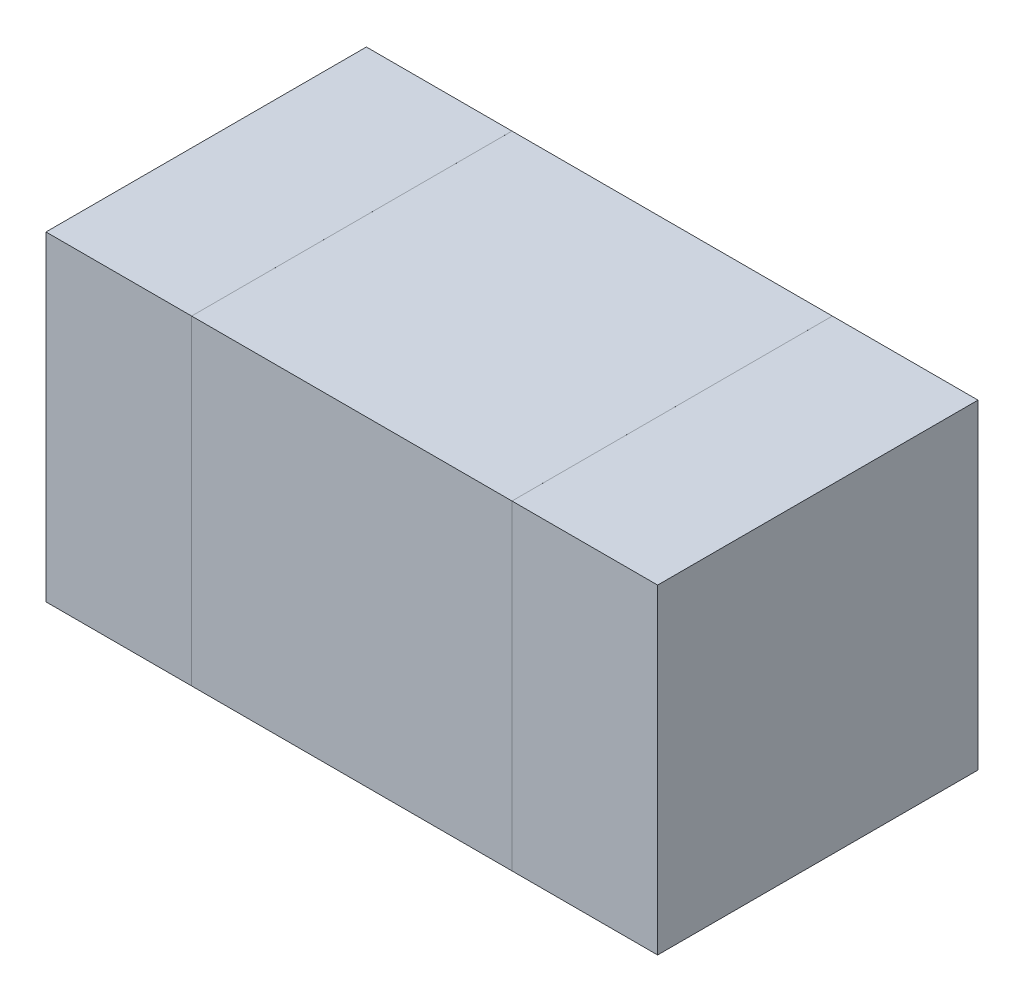
ISO-10303-21;
HEADER;
FILE_DESCRIPTION(('STEP AP214'),'2;1');
FILE_NAME('part.step','',(''),(''),'','','');
FILE_SCHEMA(('AUTOMOTIVE_DESIGN { 1 0 10303 214 1 1 1 1 }'));
ENDSEC;
DATA;
#1=APPLICATION_CONTEXT('core data for automotive mechanical design processes');
#2=APPLICATION_PROTOCOL_DEFINITION('international standard','automotive_design',2000,#1);
#3=PRODUCT_CONTEXT('',#1,'mechanical');
#4=PRODUCT('Part','Part','',(#3));
#5=PRODUCT_RELATED_PRODUCT_CATEGORY('part','',(#4));
#6=PRODUCT_DEFINITION_FORMATION('','',#4);
#7=PRODUCT_DEFINITION_CONTEXT('part definition',#1,'design');
#8=PRODUCT_DEFINITION('design','',#6,#7);
#9=PRODUCT_DEFINITION_SHAPE('','',#8);
#10=(LENGTH_UNIT() NAMED_UNIT(*) SI_UNIT(.MILLI.,.METRE.));
#11=(NAMED_UNIT(*) PLANE_ANGLE_UNIT() SI_UNIT($,.RADIAN.));
#12=(NAMED_UNIT(*) SI_UNIT($,.STERADIAN.) SOLID_ANGLE_UNIT());
#13=UNCERTAINTY_MEASURE_WITH_UNIT(LENGTH_MEASURE(1.E-05),#10,'distance_accuracy_value','');
#14=(GEOMETRIC_REPRESENTATION_CONTEXT(3) GLOBAL_UNCERTAINTY_ASSIGNED_CONTEXT((#13)) GLOBAL_UNIT_ASSIGNED_CONTEXT((#10,
#11,#12)) REPRESENTATION_CONTEXT('',''));
#15=CARTESIAN_POINT('',(0.,0.,0.));
#16=DIRECTION('',(0.,0.,1.));
#17=DIRECTION('',(1.,0.,0.));
#18=AXIS2_PLACEMENT_3D('',#15,#16,#17);
#19=CARTESIAN_POINT('',(3.460000129453,12.279998129141,0.32999934));
#20=DIRECTION('',(0.,0.,-1.));
#21=DIRECTION('',(0.,-1.,0.));
#22=AXIS2_PLACEMENT_3D('',#19,#20,#21);
#23=PLANE('',#22);
#24=DIRECTION('',(1.,0.,0.));
#25=VECTOR('',#24,1.);
#26=CARTESIAN_POINT('',(3.460000129453,12.279998129141,0.32999934));
#27=LINE('',#26,#25);
#28=CARTESIAN_POINT('',(3.460000129453,12.279998129141,0.32999934));
#29=VERTEX_POINT('',#28);
#30=CARTESIAN_POINT('',(3.790002009453,12.279998129141,0.32999934));
#31=VERTEX_POINT('',#30);
#32=EDGE_CURVE('P0_E78',#29,#31,#27,.T.);
#33=ORIENTED_EDGE('',*,*,#32,.T.);
#34=DIRECTION('',(0.,1.,0.));
#35=VECTOR('',#34,1.);
#36=CARTESIAN_POINT('',(3.790002009453,12.279998129141,0.32999934));
#37=LINE('',#36,#35);
#38=CARTESIAN_POINT('',(3.790002009453,12.609997469141,0.32999934));
#39=VERTEX_POINT('',#38);
#40=EDGE_CURVE('P0_E76',#31,#39,#37,.T.);
#41=ORIENTED_EDGE('',*,*,#40,.T.);
#42=DIRECTION('',(-1.,0.,0.));
#43=VECTOR('',#42,1.);
#44=CARTESIAN_POINT('',(3.790002009453,12.609997469141,0.32999934));
#45=LINE('',#44,#43);
#46=CARTESIAN_POINT('',(3.460000129453,12.609997469141,0.32999934));
#47=VERTEX_POINT('',#46);
#48=EDGE_CURVE('P0_E66',#39,#47,#45,.T.);
#49=ORIENTED_EDGE('',*,*,#48,.T.);
#50=DIRECTION('',(0.,-1.,0.));
#51=VECTOR('',#50,1.);
#52=CARTESIAN_POINT('',(3.460000129453,12.609997469141,0.32999934));
#53=LINE('',#52,#51);
#54=EDGE_CURVE('P0_E11',#47,#29,#53,.T.);
#55=ORIENTED_EDGE('',*,*,#54,.T.);
#56=EDGE_LOOP('',(#33,#41,#49,#55));
#57=FACE_BOUND('',#56,.T.);
#58=ADVANCED_FACE('P0_F17',(#57),#23,.F.);
#59=CARTESIAN_POINT('',(3.460000129453,12.279998129141,0.));
#60=DIRECTION('',(0.,0.,-1.));
#61=DIRECTION('',(0.,-1.,0.));
#62=AXIS2_PLACEMENT_3D('',#59,#60,#61);
#63=PLANE('',#62);
#64=DIRECTION('',(0.,-1.,0.));
#65=VECTOR('',#64,1.);
#66=CARTESIAN_POINT('',(3.460000129453,12.609997469141,0.));
#67=LINE('',#66,#65);
#68=CARTESIAN_POINT('',(3.460000129453,12.609997469141,0.));
#69=VERTEX_POINT('',#68);
#70=CARTESIAN_POINT('',(3.460000129453,12.279998129141,0.));
#71=VERTEX_POINT('',#70);
#72=EDGE_CURVE('P0_E20',#69,#71,#67,.T.);
#73=ORIENTED_EDGE('',*,*,#72,.F.);
#74=DIRECTION('',(-1.,0.,0.));
#75=VECTOR('',#74,1.);
#76=CARTESIAN_POINT('',(3.790002009453,12.609997469141,0.));
#77=LINE('',#76,#75);
#78=CARTESIAN_POINT('',(3.790002009453,12.609997469141,0.));
#79=VERTEX_POINT('',#78);
#80=EDGE_CURVE('P0_E59',#79,#69,#77,.T.);
#81=ORIENTED_EDGE('',*,*,#80,.F.);
#82=DIRECTION('',(0.,1.,0.));
#83=VECTOR('',#82,1.);
#84=CARTESIAN_POINT('',(3.790002009453,12.279998129141,0.));
#85=LINE('',#84,#83);
#86=CARTESIAN_POINT('',(3.790002009453,12.279998129141,0.));
#87=VERTEX_POINT('',#86);
#88=EDGE_CURVE('P0_E85',#87,#79,#85,.T.);
#89=ORIENTED_EDGE('',*,*,#88,.F.);
#90=DIRECTION('',(1.,0.,0.));
#91=VECTOR('',#90,1.);
#92=CARTESIAN_POINT('',(3.460000129453,12.279998129141,0.));
#93=LINE('',#92,#91);
#94=EDGE_CURVE('P0_E100',#71,#87,#93,.T.);
#95=ORIENTED_EDGE('',*,*,#94,.F.);
#96=EDGE_LOOP('',(#73,#81,#89,#95));
#97=FACE_BOUND('',#96,.T.);
#98=ADVANCED_FACE('P0_F122',(#97),#63,.T.);
#99=CARTESIAN_POINT('',(3.460000129453,12.609997469141,0.));
#100=DIRECTION('',(1.,0.,0.));
#101=DIRECTION('',(0.,1.,0.));
#102=AXIS2_PLACEMENT_3D('',#99,#100,#101);
#103=PLANE('',#102);
#104=ORIENTED_EDGE('',*,*,#72,.T.);
#105=DIRECTION('',(0.,0.,1.));
#106=VECTOR('',#105,1.);
#107=CARTESIAN_POINT('',(3.460000129453,12.279998129141,0.));
#108=LINE('',#107,#106);
#109=EDGE_CURVE('P0_E90',#71,#29,#108,.T.);
#110=ORIENTED_EDGE('',*,*,#109,.T.);
#111=ORIENTED_EDGE('',*,*,#54,.F.);
#112=DIRECTION('',(0.,0.,1.));
#113=VECTOR('',#112,1.);
#114=CARTESIAN_POINT('',(3.460000129453,12.609997469141,0.));
#115=LINE('',#114,#113);
#116=EDGE_CURVE('P0_E72',#69,#47,#115,.T.);
#117=ORIENTED_EDGE('',*,*,#116,.F.);
#118=EDGE_LOOP('',(#104,#110,#111,#117));
#119=FACE_BOUND('',#118,.T.);
#120=ADVANCED_FACE('P0_F128',(#119),#103,.F.);
#121=CARTESIAN_POINT('',(3.790002009453,12.609997469141,0.));
#122=DIRECTION('',(0.,-1.,0.));
#123=DIRECTION('',(0.,0.,-1.));
#124=AXIS2_PLACEMENT_3D('',#121,#122,#123);
#125=PLANE('',#124);
#126=ORIENTED_EDGE('',*,*,#80,.T.);
#127=ORIENTED_EDGE('',*,*,#116,.T.);
#128=ORIENTED_EDGE('',*,*,#48,.F.);
#129=DIRECTION('',(0.,0.,1.));
#130=VECTOR('',#129,1.);
#131=CARTESIAN_POINT('',(3.790002009453,12.609997469141,0.));
#132=LINE('',#131,#130);
#133=EDGE_CURVE('P0_E70',#79,#39,#132,.T.);
#134=ORIENTED_EDGE('',*,*,#133,.F.);
#135=EDGE_LOOP('',(#126,#127,#128,#134));
#136=FACE_BOUND('',#135,.T.);
#137=ADVANCED_FACE('P0_F68',(#136),#125,.F.);
#138=CARTESIAN_POINT('',(3.790002009453,12.279998129141,0.));
#139=DIRECTION('',(-1.,0.,0.));
#140=DIRECTION('',(0.,0.,1.));
#141=AXIS2_PLACEMENT_3D('',#138,#139,#140);
#142=PLANE('',#141);
#143=ORIENTED_EDGE('',*,*,#88,.T.);
#144=ORIENTED_EDGE('',*,*,#133,.T.);
#145=ORIENTED_EDGE('',*,*,#40,.F.);
#146=DIRECTION('',(0.,0.,1.));
#147=VECTOR('',#146,1.);
#148=CARTESIAN_POINT('',(3.790002009453,12.279998129141,0.));
#149=LINE('',#148,#147);
#150=EDGE_CURVE('P0_E97',#87,#31,#149,.T.);
#151=ORIENTED_EDGE('',*,*,#150,.F.);
#152=EDGE_LOOP('',(#143,#144,#145,#151));
#153=FACE_BOUND('',#152,.T.);
#154=ADVANCED_FACE('P0_F84',(#153),#142,.F.);
#155=CARTESIAN_POINT('',(3.460000129453,12.279998129141,0.));
#156=DIRECTION('',(0.,1.,0.));
#157=DIRECTION('',(1.,0.,0.));
#158=AXIS2_PLACEMENT_3D('',#155,#156,#157);
#159=PLANE('',#158);
#160=ORIENTED_EDGE('',*,*,#94,.T.);
#161=ORIENTED_EDGE('',*,*,#150,.T.);
#162=ORIENTED_EDGE('',*,*,#32,.F.);
#163=ORIENTED_EDGE('',*,*,#109,.F.);
#164=EDGE_LOOP('',(#160,#161,#162,#163));
#165=FACE_BOUND('',#164,.T.);
#166=ADVANCED_FACE('P0_F120',(#165),#159,.F.);
#167=CLOSED_SHELL('',(#58,#98,#120,#137,#154,#166));
#168=MANIFOLD_SOLID_BREP('P0_B1',#167);
#169=CARTESIAN_POINT('',(3.459996696289,12.279995589141,0.32999934));
#170=DIRECTION('',(0.,0.,-1.));
#171=DIRECTION('',(0.,-1.,0.));
#172=AXIS2_PLACEMENT_3D('',#169,#170,#171);
#173=PLANE('',#172);
#174=DIRECTION('',(0.,1.,0.));
#175=VECTOR('',#174,1.);
#176=CARTESIAN_POINT('',(3.459996696289,12.279995589141,0.32999934));
#177=LINE('',#176,#175);
#178=CARTESIAN_POINT('',(3.459996696289,12.279995589141,0.32999934));
#179=VERTEX_POINT('',#178);
#180=CARTESIAN_POINT('',(3.459996696289,12.609997469141,0.32999934));
#181=VERTEX_POINT('',#180);
#182=EDGE_CURVE('P1_E96',#179,#181,#177,.T.);
#183=ORIENTED_EDGE('',*,*,#182,.T.);
#184=DIRECTION('',(-1.,0.,0.));
#185=VECTOR('',#184,1.);
#186=CARTESIAN_POINT('',(3.459996696289,12.609997469141,0.32999934));
#187=LINE('',#186,#185);
#188=CARTESIAN_POINT('',(3.309994456289,12.609997469141,0.32999934));
#189=VERTEX_POINT('',#188);
#190=EDGE_CURVE('P1_E77',#181,#189,#187,.T.);
#191=ORIENTED_EDGE('',*,*,#190,.T.);
#192=DIRECTION('',(0.,-1.,0.));
#193=VECTOR('',#192,1.);
#194=CARTESIAN_POINT('',(3.309994456289,12.609997469141,0.32999934));
#195=LINE('',#194,#193);
#196=CARTESIAN_POINT('',(3.309994456289,12.279995589141,0.32999934));
#197=VERTEX_POINT('',#196);
#198=EDGE_CURVE('P1_E82',#189,#197,#195,.T.);
#199=ORIENTED_EDGE('',*,*,#198,.T.);
#200=DIRECTION('',(1.,0.,0.));
#201=VECTOR('',#200,1.);
#202=CARTESIAN_POINT('',(3.309994456289,12.279995589141,0.32999934));
#203=LINE('',#202,#201);
#204=EDGE_CURVE('P1_E11',#197,#179,#203,.T.);
#205=ORIENTED_EDGE('',*,*,#204,.T.);
#206=EDGE_LOOP('',(#183,#191,#199,#205));
#207=FACE_BOUND('',#206,.T.);
#208=ADVANCED_FACE('P1_F17',(#207),#173,.F.);
#209=CARTESIAN_POINT('',(3.459996696289,12.279995589141,0.));
#210=DIRECTION('',(0.,0.,-1.));
#211=DIRECTION('',(0.,-1.,0.));
#212=AXIS2_PLACEMENT_3D('',#209,#210,#211);
#213=PLANE('',#212);
#214=DIRECTION('',(1.,0.,0.));
#215=VECTOR('',#214,1.);
#216=CARTESIAN_POINT('',(3.309994456289,12.279995589141,0.));
#217=LINE('',#216,#215);
#218=CARTESIAN_POINT('',(3.309994456289,12.279995589141,0.));
#219=VERTEX_POINT('',#218);
#220=CARTESIAN_POINT('',(3.459996696289,12.279995589141,0.));
#221=VERTEX_POINT('',#220);
#222=EDGE_CURVE('P1_E26',#219,#221,#217,.T.);
#223=ORIENTED_EDGE('',*,*,#222,.F.);
#224=DIRECTION('',(0.,-1.,0.));
#225=VECTOR('',#224,1.);
#226=CARTESIAN_POINT('',(3.309994456289,12.609997469141,0.));
#227=LINE('',#226,#225);
#228=CARTESIAN_POINT('',(3.309994456289,12.609997469141,0.));
#229=VERTEX_POINT('',#228);
#230=EDGE_CURVE('P1_E68',#229,#219,#227,.T.);
#231=ORIENTED_EDGE('',*,*,#230,.F.);
#232=DIRECTION('',(-1.,0.,0.));
#233=VECTOR('',#232,1.);
#234=CARTESIAN_POINT('',(3.459996696289,12.609997469141,0.));
#235=LINE('',#234,#233);
#236=CARTESIAN_POINT('',(3.459996696289,12.609997469141,0.));
#237=VERTEX_POINT('',#236);
#238=EDGE_CURVE('P1_E72',#237,#229,#235,.T.);
#239=ORIENTED_EDGE('',*,*,#238,.F.);
#240=DIRECTION('',(0.,1.,0.));
#241=VECTOR('',#240,1.);
#242=CARTESIAN_POINT('',(3.459996696289,12.279995589141,0.));
#243=LINE('',#242,#241);
#244=EDGE_CURVE('P1_E111',#221,#237,#243,.T.);
#245=ORIENTED_EDGE('',*,*,#244,.F.);
#246=EDGE_LOOP('',(#223,#231,#239,#245));
#247=FACE_BOUND('',#246,.T.);
#248=ADVANCED_FACE('P1_F70',(#247),#213,.T.);
#249=CARTESIAN_POINT('',(3.309994456289,12.279995589141,0.));
#250=DIRECTION('',(0.,1.,0.));
#251=DIRECTION('',(1.,0.,0.));
#252=AXIS2_PLACEMENT_3D('',#249,#250,#251);
#253=PLANE('',#252);
#254=ORIENTED_EDGE('',*,*,#222,.T.);
#255=DIRECTION('',(0.,0.,1.));
#256=VECTOR('',#255,1.);
#257=CARTESIAN_POINT('',(3.459996696289,12.279995589141,0.));
#258=LINE('',#257,#256);
#259=EDGE_CURVE('P1_E92',#221,#179,#258,.T.);
#260=ORIENTED_EDGE('',*,*,#259,.T.);
#261=ORIENTED_EDGE('',*,*,#204,.F.);
#262=DIRECTION('',(0.,0.,1.));
#263=VECTOR('',#262,1.);
#264=CARTESIAN_POINT('',(3.309994456289,12.279995589141,0.));
#265=LINE('',#264,#263);
#266=EDGE_CURVE('P1_E20',#219,#197,#265,.T.);
#267=ORIENTED_EDGE('',*,*,#266,.F.);
#268=EDGE_LOOP('',(#254,#260,#261,#267));
#269=FACE_BOUND('',#268,.T.);
#270=ADVANCED_FACE('P1_F120',(#269),#253,.F.);
#271=CARTESIAN_POINT('',(3.309994456289,12.609997469141,0.));
#272=DIRECTION('',(1.,0.,0.));
#273=DIRECTION('',(0.,1.,0.));
#274=AXIS2_PLACEMENT_3D('',#271,#272,#273);
#275=PLANE('',#274);
#276=ORIENTED_EDGE('',*,*,#230,.T.);
#277=ORIENTED_EDGE('',*,*,#266,.T.);
#278=ORIENTED_EDGE('',*,*,#198,.F.);
#279=DIRECTION('',(0.,0.,1.));
#280=VECTOR('',#279,1.);
#281=CARTESIAN_POINT('',(3.309994456289,12.609997469141,0.));
#282=LINE('',#281,#280);
#283=EDGE_CURVE('P1_E80',#229,#189,#282,.T.);
#284=ORIENTED_EDGE('',*,*,#283,.F.);
#285=EDGE_LOOP('',(#276,#277,#278,#284));
#286=FACE_BOUND('',#285,.T.);
#287=ADVANCED_FACE('P1_F81',(#286),#275,.F.);
#288=CARTESIAN_POINT('',(3.459996696289,12.609997469141,0.));
#289=DIRECTION('',(0.,-1.,0.));
#290=DIRECTION('',(0.,0.,-1.));
#291=AXIS2_PLACEMENT_3D('',#288,#289,#290);
#292=PLANE('',#291);
#293=ORIENTED_EDGE('',*,*,#238,.T.);
#294=ORIENTED_EDGE('',*,*,#283,.T.);
#295=ORIENTED_EDGE('',*,*,#190,.F.);
#296=DIRECTION('',(0.,0.,1.));
#297=VECTOR('',#296,1.);
#298=CARTESIAN_POINT('',(3.459996696289,12.609997469141,0.));
#299=LINE('',#298,#297);
#300=EDGE_CURVE('P1_E89',#237,#181,#299,.T.);
#301=ORIENTED_EDGE('',*,*,#300,.F.);
#302=EDGE_LOOP('',(#293,#294,#295,#301));
#303=FACE_BOUND('',#302,.T.);
#304=ADVANCED_FACE('P1_F87',(#303),#292,.F.);
#305=CARTESIAN_POINT('',(3.459996696289,12.279995589141,0.));
#306=DIRECTION('',(-1.,0.,0.));
#307=DIRECTION('',(0.,0.,1.));
#308=AXIS2_PLACEMENT_3D('',#305,#306,#307);
#309=PLANE('',#308);
#310=ORIENTED_EDGE('',*,*,#244,.T.);
#311=ORIENTED_EDGE('',*,*,#300,.T.);
#312=ORIENTED_EDGE('',*,*,#182,.F.);
#313=ORIENTED_EDGE('',*,*,#259,.F.);
#314=EDGE_LOOP('',(#310,#311,#312,#313));
#315=FACE_BOUND('',#314,.T.);
#316=ADVANCED_FACE('P1_F110',(#315),#309,.F.);
#317=CLOSED_SHELL('',(#208,#248,#270,#287,#304,#316));
#318=MANIFOLD_SOLID_BREP('P1_B1',#317);
#319=CARTESIAN_POINT('',(3.940007682617,12.279995589141,0.32999934));
#320=DIRECTION('',(0.,0.,-1.));
#321=DIRECTION('',(0.,-1.,0.));
#322=AXIS2_PLACEMENT_3D('',#319,#320,#321);
#323=PLANE('',#322);
#324=DIRECTION('',(0.,1.,0.));
#325=VECTOR('',#324,1.);
#326=CARTESIAN_POINT('',(3.940007682617,12.279995589141,0.32999934));
#327=LINE('',#326,#325);
#328=CARTESIAN_POINT('',(3.940007682617,12.279995589141,0.32999934));
#329=VERTEX_POINT('',#328);
#330=CARTESIAN_POINT('',(3.940007682617,12.609997469141,0.32999934));
#331=VERTEX_POINT('',#330);
#332=EDGE_CURVE('P2_E93',#329,#331,#327,.T.);
#333=ORIENTED_EDGE('',*,*,#332,.T.);
#334=DIRECTION('',(-1.,0.,0.));
#335=VECTOR('',#334,1.);
#336=CARTESIAN_POINT('',(3.940007682617,12.609997469141,0.32999934));
#337=LINE('',#336,#335);
#338=CARTESIAN_POINT('',(3.790005442617,12.609997469141,0.32999934));
#339=VERTEX_POINT('',#338);
#340=EDGE_CURVE('P2_E72',#331,#339,#337,.T.);
#341=ORIENTED_EDGE('',*,*,#340,.T.);
#342=DIRECTION('',(0.,-1.,0.));
#343=VECTOR('',#342,1.);
#344=CARTESIAN_POINT('',(3.790005442617,12.609997469141,0.32999934));
#345=LINE('',#344,#343);
#346=CARTESIAN_POINT('',(3.790005442617,12.279995589141,0.32999934));
#347=VERTEX_POINT('',#346);
#348=EDGE_CURVE('P2_E76',#339,#347,#345,.T.);
#349=ORIENTED_EDGE('',*,*,#348,.T.);
#350=DIRECTION('',(1.,0.,0.));
#351=VECTOR('',#350,1.);
#352=CARTESIAN_POINT('',(3.790005442617,12.279995589141,0.32999934));
#353=LINE('',#352,#351);
#354=EDGE_CURVE('P2_E11',#347,#329,#353,.T.);
#355=ORIENTED_EDGE('',*,*,#354,.T.);
#356=EDGE_LOOP('',(#333,#341,#349,#355));
#357=FACE_BOUND('',#356,.T.);
#358=ADVANCED_FACE('P2_F17',(#357),#323,.F.);
#359=CARTESIAN_POINT('',(3.940007682617,12.279995589141,0.));
#360=DIRECTION('',(0.,0.,-1.));
#361=DIRECTION('',(0.,-1.,0.));
#362=AXIS2_PLACEMENT_3D('',#359,#360,#361);
#363=PLANE('',#362);
#364=DIRECTION('',(1.,0.,0.));
#365=VECTOR('',#364,1.);
#366=CARTESIAN_POINT('',(3.790005442617,12.279995589141,0.));
#367=LINE('',#366,#365);
#368=CARTESIAN_POINT('',(3.790005442617,12.279995589141,0.));
#369=VERTEX_POINT('',#368);
#370=CARTESIAN_POINT('',(3.940007682617,12.279995589141,0.));
#371=VERTEX_POINT('',#370);
#372=EDGE_CURVE('P2_E20',#369,#371,#367,.T.);
#373=ORIENTED_EDGE('',*,*,#372,.F.);
#374=DIRECTION('',(0.,-1.,0.));
#375=VECTOR('',#374,1.);
#376=CARTESIAN_POINT('',(3.790005442617,12.609997469141,0.));
#377=LINE('',#376,#375);
#378=CARTESIAN_POINT('',(3.790005442617,12.609997469141,0.));
#379=VERTEX_POINT('',#378);
#380=EDGE_CURVE('P2_E61',#379,#369,#377,.T.);
#381=ORIENTED_EDGE('',*,*,#380,.F.);
#382=DIRECTION('',(-1.,0.,0.));
#383=VECTOR('',#382,1.);
#384=CARTESIAN_POINT('',(3.940007682617,12.609997469141,0.));
#385=LINE('',#384,#383);
#386=CARTESIAN_POINT('',(3.940007682617,12.609997469141,0.));
#387=VERTEX_POINT('',#386);
#388=EDGE_CURVE('P2_E66',#387,#379,#385,.T.);
#389=ORIENTED_EDGE('',*,*,#388,.F.);
#390=DIRECTION('',(0.,1.,0.));
#391=VECTOR('',#390,1.);
#392=CARTESIAN_POINT('',(3.940007682617,12.279995589141,0.));
#393=LINE('',#392,#391);
#394=EDGE_CURVE('P2_E99',#371,#387,#393,.T.);
#395=ORIENTED_EDGE('',*,*,#394,.F.);
#396=EDGE_LOOP('',(#373,#381,#389,#395));
#397=FACE_BOUND('',#396,.T.);
#398=ADVANCED_FACE('P2_F63',(#397),#363,.T.);
#399=CARTESIAN_POINT('',(3.790005442617,12.279995589141,0.));
#400=DIRECTION('',(0.,1.,0.));
#401=DIRECTION('',(1.,0.,0.));
#402=AXIS2_PLACEMENT_3D('',#399,#400,#401);
#403=PLANE('',#402);
#404=ORIENTED_EDGE('',*,*,#372,.T.);
#405=DIRECTION('',(0.,0.,1.));
#406=VECTOR('',#405,1.);
#407=CARTESIAN_POINT('',(3.940007682617,12.279995589141,0.));
#408=LINE('',#407,#406);
#409=EDGE_CURVE('P2_E87',#371,#329,#408,.T.);
#410=ORIENTED_EDGE('',*,*,#409,.T.);
#411=ORIENTED_EDGE('',*,*,#354,.F.);
#412=DIRECTION('',(0.,0.,1.));
#413=VECTOR('',#412,1.);
#414=CARTESIAN_POINT('',(3.790005442617,12.279995589141,0.));
#415=LINE('',#414,#413);
#416=EDGE_CURVE('P2_E71',#369,#347,#415,.T.);
#417=ORIENTED_EDGE('',*,*,#416,.F.);
#418=EDGE_LOOP('',(#404,#410,#411,#417));
#419=FACE_BOUND('',#418,.T.);
#420=ADVANCED_FACE('P2_F116',(#419),#403,.F.);
#421=CARTESIAN_POINT('',(3.790005442617,12.609997469141,0.));
#422=DIRECTION('',(1.,0.,0.));
#423=DIRECTION('',(0.,1.,0.));
#424=AXIS2_PLACEMENT_3D('',#421,#422,#423);
#425=PLANE('',#424);
#426=ORIENTED_EDGE('',*,*,#380,.T.);
#427=ORIENTED_EDGE('',*,*,#416,.T.);
#428=ORIENTED_EDGE('',*,*,#348,.F.);
#429=DIRECTION('',(0.,0.,1.));
#430=VECTOR('',#429,1.);
#431=CARTESIAN_POINT('',(3.790005442617,12.609997469141,0.));
#432=LINE('',#431,#430);
#433=EDGE_CURVE('P2_E74',#379,#339,#432,.T.);
#434=ORIENTED_EDGE('',*,*,#433,.F.);
#435=EDGE_LOOP('',(#426,#427,#428,#434));
#436=FACE_BOUND('',#435,.T.);
#437=ADVANCED_FACE('P2_F75',(#436),#425,.F.);
#438=CARTESIAN_POINT('',(3.940007682617,12.609997469141,0.));
#439=DIRECTION('',(0.,-1.,0.));
#440=DIRECTION('',(0.,0.,-1.));
#441=AXIS2_PLACEMENT_3D('',#438,#439,#440);
#442=PLANE('',#441);
#443=ORIENTED_EDGE('',*,*,#388,.T.);
#444=ORIENTED_EDGE('',*,*,#433,.T.);
#445=ORIENTED_EDGE('',*,*,#340,.F.);
#446=DIRECTION('',(0.,0.,1.));
#447=VECTOR('',#446,1.);
#448=CARTESIAN_POINT('',(3.940007682617,12.609997469141,0.));
#449=LINE('',#448,#447);
#450=EDGE_CURVE('P2_E84',#387,#331,#449,.T.);
#451=ORIENTED_EDGE('',*,*,#450,.F.);
#452=EDGE_LOOP('',(#443,#444,#445,#451));
#453=FACE_BOUND('',#452,.T.);
#454=ADVANCED_FACE('P2_F82',(#453),#442,.F.);
#455=CARTESIAN_POINT('',(3.940007682617,12.279995589141,0.));
#456=DIRECTION('',(-1.,0.,0.));
#457=DIRECTION('',(0.,0.,1.));
#458=AXIS2_PLACEMENT_3D('',#455,#456,#457);
#459=PLANE('',#458);
#460=ORIENTED_EDGE('',*,*,#394,.T.);
#461=ORIENTED_EDGE('',*,*,#450,.T.);
#462=ORIENTED_EDGE('',*,*,#332,.F.);
#463=ORIENTED_EDGE('',*,*,#409,.F.);
#464=EDGE_LOOP('',(#460,#461,#462,#463));
#465=FACE_BOUND('',#464,.T.);
#466=ADVANCED_FACE('P2_F119',(#465),#459,.F.);
#467=CLOSED_SHELL('',(#358,#398,#420,#437,#454,#466));
#468=MANIFOLD_SOLID_BREP('P2_B1',#467);
#469=ADVANCED_BREP_SHAPE_REPRESENTATION('',(#18,#168,#318,#468),#14);
#470=SHAPE_DEFINITION_REPRESENTATION(#9,#469);
ENDSEC;
END-ISO-10303-21;
